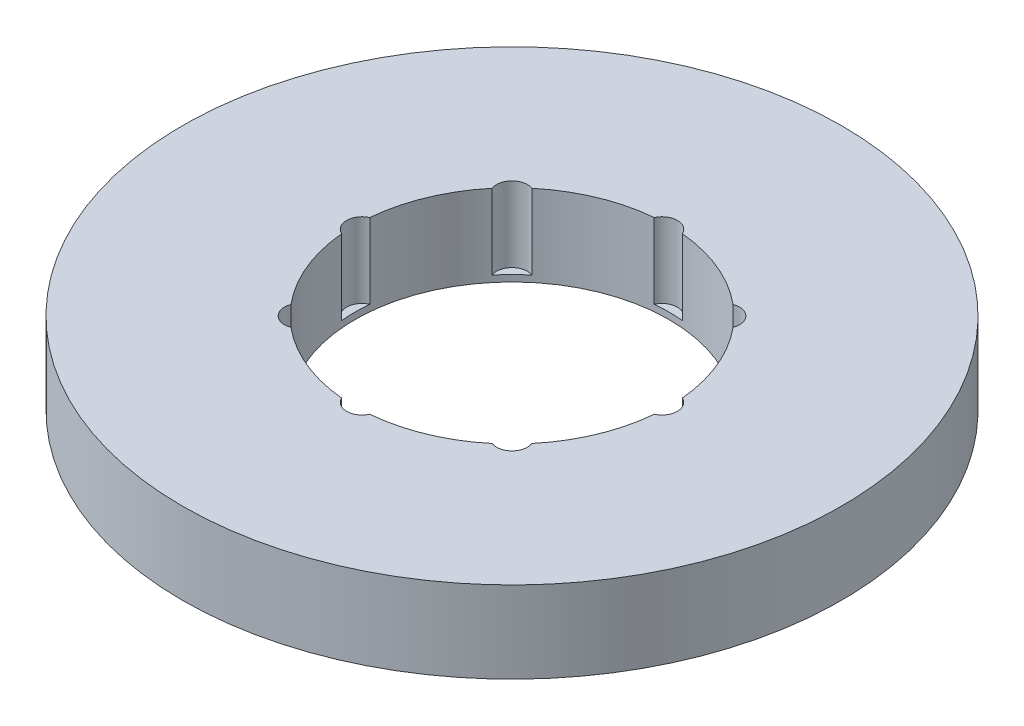
ISO-10303-21;
HEADER;
FILE_DESCRIPTION(('STEP AP214'),'2;1');
FILE_NAME('part.step','',(''),(''),'','','');
FILE_SCHEMA(('AUTOMOTIVE_DESIGN { 1 0 10303 214 1 1 1 1 }'));
ENDSEC;
DATA;
#1=APPLICATION_CONTEXT('core data for automotive mechanical design processes');
#2=APPLICATION_PROTOCOL_DEFINITION('international standard','automotive_design',2000,#1);
#3=PRODUCT_CONTEXT('',#1,'mechanical');
#4=PRODUCT('Part','Part','',(#3));
#5=PRODUCT_RELATED_PRODUCT_CATEGORY('part','',(#4));
#6=PRODUCT_DEFINITION_FORMATION('','',#4);
#7=PRODUCT_DEFINITION_CONTEXT('part definition',#1,'design');
#8=PRODUCT_DEFINITION('design','',#6,#7);
#9=PRODUCT_DEFINITION_SHAPE('','',#8);
#10=(LENGTH_UNIT() NAMED_UNIT(*) SI_UNIT(.MILLI.,.METRE.));
#11=(NAMED_UNIT(*) PLANE_ANGLE_UNIT() SI_UNIT($,.RADIAN.));
#12=(NAMED_UNIT(*) SI_UNIT($,.STERADIAN.) SOLID_ANGLE_UNIT());
#13=UNCERTAINTY_MEASURE_WITH_UNIT(LENGTH_MEASURE(1.E-05),#10,'distance_accuracy_value','');
#14=(GEOMETRIC_REPRESENTATION_CONTEXT(3) GLOBAL_UNCERTAINTY_ASSIGNED_CONTEXT((#13)) GLOBAL_UNIT_ASSIGNED_CONTEXT((#10,
#11,#12)) REPRESENTATION_CONTEXT('',''));
#15=CARTESIAN_POINT('',(0.,0.,0.));
#16=DIRECTION('',(0.,0.,1.));
#17=DIRECTION('',(1.,0.,0.));
#18=AXIS2_PLACEMENT_3D('',#15,#16,#17);
#19=CARTESIAN_POINT('',(0.,13.,0.));
#20=DIRECTION('',(0.,-1.,0.));
#21=DIRECTION('',(0.,0.,-1.));
#22=AXIS2_PLACEMENT_3D('',#19,#20,#21);
#23=CYLINDRICAL_SURFACE('',#22,52.5);
#24=CARTESIAN_POINT('',(0.,13.,0.));
#25=DIRECTION('',(0.,1.,0.));
#26=DIRECTION('',(0.,0.,1.));
#27=AXIS2_PLACEMENT_3D('',#24,#25,#26);
#28=CIRCLE('',#27,52.5);
#29=CARTESIAN_POINT('',(0.,13.,-52.5));
#30=VERTEX_POINT('',#29);
#31=EDGE_CURVE('E183',#30,#30,#28,.T.);
#32=CARTESIAN_POINT('',(0.,0.,0.));
#33=DIRECTION('',(0.,1.,0.));
#34=DIRECTION('',(0.,0.,1.));
#35=AXIS2_PLACEMENT_3D('',#32,#33,#34);
#36=CIRCLE('',#35,52.5);
#37=CARTESIAN_POINT('',(0.,0.,-52.5));
#38=VERTEX_POINT('',#37);
#39=EDGE_CURVE('E182',#38,#38,#36,.T.);
#40=CARTESIAN_POINT('',(0.,13.,-52.5));
#41=CARTESIAN_POINT('',(0.,12.8645833333333,-52.5));
#42=CARTESIAN_POINT('',(0.,12.7291666666667,-52.5));
#43=CARTESIAN_POINT('',(0.,12.4583333333333,-52.5));
#44=CARTESIAN_POINT('',(0.,12.3229166666667,-52.5));
#45=CARTESIAN_POINT('',(0.,12.0520833333333,-52.5));
#46=CARTESIAN_POINT('',(0.,11.9166666666667,-52.5));
#47=CARTESIAN_POINT('',(0.,11.6458333333333,-52.5));
#48=CARTESIAN_POINT('',(0.,11.5104166666667,-52.5));
#49=CARTESIAN_POINT('',(0.,11.2395833333333,-52.5));
#50=CARTESIAN_POINT('',(0.,11.1041666666667,-52.5));
#51=CARTESIAN_POINT('',(0.,10.8333333333333,-52.5));
#52=CARTESIAN_POINT('',(0.,10.6979166666667,-52.5));
#53=CARTESIAN_POINT('',(0.,10.4270833333333,-52.5));
#54=CARTESIAN_POINT('',(0.,10.2916666666667,-52.5));
#55=CARTESIAN_POINT('',(0.,10.0208333333333,-52.5));
#56=CARTESIAN_POINT('',(0.,9.88541666666667,-52.5));
#57=CARTESIAN_POINT('',(0.,9.61458333333333,-52.5));
#58=CARTESIAN_POINT('',(0.,9.47916666666667,-52.5));
#59=CARTESIAN_POINT('',(0.,9.20833333333333,-52.5));
#60=CARTESIAN_POINT('',(0.,9.07291666666667,-52.5));
#61=CARTESIAN_POINT('',(0.,8.80208333333333,-52.5));
#62=CARTESIAN_POINT('',(0.,8.66666666666667,-52.5));
#63=CARTESIAN_POINT('',(0.,8.39583333333333,-52.5));
#64=CARTESIAN_POINT('',(0.,8.26041666666667,-52.5));
#65=CARTESIAN_POINT('',(0.,7.98958333333333,-52.5));
#66=CARTESIAN_POINT('',(0.,7.85416666666667,-52.5));
#67=CARTESIAN_POINT('',(0.,7.58333333333333,-52.5));
#68=CARTESIAN_POINT('',(0.,7.44791666666667,-52.5));
#69=CARTESIAN_POINT('',(0.,7.17708333333333,-52.5));
#70=CARTESIAN_POINT('',(0.,7.04166666666667,-52.5));
#71=CARTESIAN_POINT('',(0.,6.77083333333333,-52.5));
#72=CARTESIAN_POINT('',(0.,6.63541666666667,-52.5));
#73=CARTESIAN_POINT('',(0.,6.36458333333333,-52.5));
#74=CARTESIAN_POINT('',(0.,6.22916666666667,-52.5));
#75=CARTESIAN_POINT('',(0.,5.95833333333333,-52.5));
#76=CARTESIAN_POINT('',(0.,5.82291666666667,-52.5));
#77=CARTESIAN_POINT('',(0.,5.55208333333333,-52.5));
#78=CARTESIAN_POINT('',(0.,5.41666666666667,-52.5));
#79=CARTESIAN_POINT('',(0.,5.14583333333333,-52.5));
#80=CARTESIAN_POINT('',(0.,5.01041666666667,-52.5));
#81=CARTESIAN_POINT('',(0.,4.73958333333333,-52.5));
#82=CARTESIAN_POINT('',(0.,4.60416666666667,-52.5));
#83=CARTESIAN_POINT('',(0.,4.33333333333333,-52.5));
#84=CARTESIAN_POINT('',(0.,4.19791666666667,-52.5));
#85=CARTESIAN_POINT('',(0.,3.92708333333333,-52.5));
#86=CARTESIAN_POINT('',(0.,3.79166666666667,-52.5));
#87=CARTESIAN_POINT('',(0.,3.52083333333333,-52.5));
#88=CARTESIAN_POINT('',(0.,3.38541666666667,-52.5));
#89=CARTESIAN_POINT('',(0.,3.11458333333333,-52.5));
#90=CARTESIAN_POINT('',(0.,2.97916666666667,-52.5));
#91=CARTESIAN_POINT('',(0.,2.70833333333333,-52.5));
#92=CARTESIAN_POINT('',(0.,2.57291666666667,-52.5));
#93=CARTESIAN_POINT('',(0.,2.30208333333333,-52.5));
#94=CARTESIAN_POINT('',(0.,2.16666666666667,-52.5));
#95=CARTESIAN_POINT('',(0.,1.89583333333333,-52.5));
#96=CARTESIAN_POINT('',(0.,1.76041666666667,-52.5));
#97=CARTESIAN_POINT('',(0.,1.48958333333333,-52.5));
#98=CARTESIAN_POINT('',(0.,1.35416666666667,-52.5));
#99=CARTESIAN_POINT('',(0.,1.08333333333333,-52.5));
#100=CARTESIAN_POINT('',(0.,0.947916666666667,-52.5));
#101=CARTESIAN_POINT('',(0.,0.677083333333334,-52.5));
#102=CARTESIAN_POINT('',(0.,0.541666666666667,-52.5));
#103=CARTESIAN_POINT('',(0.,0.270833333333334,-52.5));
#104=CARTESIAN_POINT('',(0.,0.135416666666667,-52.5));
#105=CARTESIAN_POINT('',(0.,0.,-52.5));
#106=B_SPLINE_CURVE_WITH_KNOTS('',3,(#40,#41,#42,#43,#44,#45,#46,#47,#48,#49,#50,#51,#52,#53,
#54,#55,#56,#57,#58,#59,#60,#61,#62,#63,#64,#65,#66,#67,#68,#69,#70,#71,#72,#73,#74,#75,#76,#77,
#78,#79,#80,#81,#82,#83,#84,#85,#86,#87,#88,#89,#90,#91,#92,#93,#94,#95,#96,#97,#98,#99,#100,
#101,#102,#103,#104,#105),.UNSPECIFIED.,.F.,.F.,(4,2,2,2,2,2,2,2,2,2,2,2,2,2,2,2,2,2,2,2,2,2,2,
2,2,2,2,2,2,2,2,2,4),(0.,0.406249999999999,0.812499999999999,1.21875,1.625,2.03125,2.4375,
2.84375,3.25,3.65625,4.0625,4.46875,4.875,5.28125,5.6875,6.09375,6.5,6.90625,7.3125,7.71875,
8.125,8.53125,8.9375,9.34375,9.75,10.15625,10.5625,10.96875,11.375,11.78125,12.1875,12.59375,
13.),.UNSPECIFIED.);
#107=EDGE_CURVE('BSEAM39',#30,#38,#106,.T.);
#108=ORIENTED_EDGE('',*,*,#31,.F.);
#109=ORIENTED_EDGE('',*,*,#39,.T.);
#110=ORIENTED_EDGE('',*,*,#107,.T.);
#111=ORIENTED_EDGE('',*,*,#107,.F.);
#112=EDGE_LOOP('',(#108,#110,#109,#111));
#113=FACE_BOUND('',#112,.T.);
#114=ADVANCED_FACE('F39',(#113),#23,.T.);
#115=CARTESIAN_POINT('',(0.,13.,0.));
#116=DIRECTION('',(0.,1.,0.));
#117=DIRECTION('',(0.,0.,1.));
#118=AXIS2_PLACEMENT_3D('',#115,#116,#117);
#119=PLANE('',#118);
#120=CARTESIAN_POINT('',(0.,13.,23.8825424149674));
#121=DIRECTION('',(0.,1.,0.));
#122=DIRECTION('',(1.,0.,0.));
#123=AXIS2_PLACEMENT_3D('',#120,#121,#122);
#124=CIRCLE('',#123,2.46055285388541);
#125=CARTESIAN_POINT('',(-2.24061147688682,13.,24.8993907598086));
#126=VERTEX_POINT('',#125);
#127=CARTESIAN_POINT('',(2.24061147688699,13.,24.8993907598086));
#128=VERTEX_POINT('',#127);
#129=EDGE_CURVE('E256',#126,#128,#124,.T.);
#130=ORIENTED_EDGE('',*,*,#129,.F.);
#131=CARTESIAN_POINT('',(0.,13.,0.));
#132=DIRECTION('',(0.,1.,0.));
#133=DIRECTION('',(0.,0.,1.));
#134=AXIS2_PLACEMENT_3D('',#131,#132,#133);
#135=CIRCLE('',#134,25.);
#136=CARTESIAN_POINT('',(-16.0221764843632,13.,19.1908796229855));
#137=VERTEX_POINT('',#136);
#138=EDGE_CURVE('E175',#137,#126,#135,.T.);
#139=ORIENTED_EDGE('',*,*,#138,.F.);
#140=CARTESIAN_POINT('',(-16.8875076935988,13.,16.8875076935988));
#141=DIRECTION('',(0.,1.,0.));
#142=DIRECTION('',(0.707106781186549,0.,0.707106781186546));
#143=AXIS2_PLACEMENT_3D('',#140,#141,#142);
#144=CIRCLE('',#143,2.46055285388541);
#145=CARTESIAN_POINT('',(-19.1908796229854,13.,16.0221764843632));
#146=VERTEX_POINT('',#145);
#147=EDGE_CURVE('E152',#146,#137,#144,.T.);
#148=ORIENTED_EDGE('',*,*,#147,.F.);
#149=CARTESIAN_POINT('',(-24.8993907598086,13.,2.2406114768869));
#150=VERTEX_POINT('',#149);
#151=EDGE_CURVE('E168',#150,#146,#135,.T.);
#152=ORIENTED_EDGE('',*,*,#151,.F.);
#153=CARTESIAN_POINT('',(-23.8825424149674,13.,0.));
#154=DIRECTION('',(0.,1.,0.));
#155=DIRECTION('',(0.,0.,1.));
#156=AXIS2_PLACEMENT_3D('',#153,#154,#155);
#157=CIRCLE('',#156,2.46055285388541);
#158=CARTESIAN_POINT('',(-24.8993907598086,13.,-2.2406114768869));
#159=VERTEX_POINT('',#158);
#160=EDGE_CURVE('E205',#159,#150,#157,.T.);
#161=ORIENTED_EDGE('',*,*,#160,.F.);
#162=CARTESIAN_POINT('',(-19.1908796229857,13.,-16.022176484363));
#163=VERTEX_POINT('',#162);
#164=EDGE_CURVE('E181',#163,#159,#135,.T.);
#165=ORIENTED_EDGE('',*,*,#164,.F.);
#166=CARTESIAN_POINT('',(-16.887507693599,13.,-16.8875076935986));
#167=DIRECTION('',(0.,1.,0.));
#168=DIRECTION('',(-0.707106781186539,0.,0.707106781186556));
#169=AXIS2_PLACEMENT_3D('',#166,#167,#168);
#170=CIRCLE('',#169,2.46055285388541);
#171=CARTESIAN_POINT('',(-16.0221764843634,13.,-19.1908796229853));
#172=VERTEX_POINT('',#171);
#173=EDGE_CURVE('E453',#172,#163,#170,.T.);
#174=ORIENTED_EDGE('',*,*,#173,.F.);
#175=CARTESIAN_POINT('',(-2.24061147688716,13.,-24.8993907598086));
#176=VERTEX_POINT('',#175);
#177=EDGE_CURVE('E189',#176,#172,#135,.T.);
#178=ORIENTED_EDGE('',*,*,#177,.F.);
#179=CARTESIAN_POINT('',(-2.50156353497965E-13,13.,-23.8825424149674));
#180=DIRECTION('',(0.,1.,0.));
#181=DIRECTION('',(-1.,0.,0.));
#182=AXIS2_PLACEMENT_3D('',#179,#180,#181);
#183=CIRCLE('',#182,2.46055285388541);
#184=CARTESIAN_POINT('',(2.24061147688664,13.,-24.8993907598086));
#185=VERTEX_POINT('',#184);
#186=EDGE_CURVE('E462',#185,#176,#183,.T.);
#187=ORIENTED_EDGE('',*,*,#186,.F.);
#188=CARTESIAN_POINT('',(16.022176484363,13.,-19.1908796229856));
#189=VERTEX_POINT('',#188);
#190=EDGE_CURVE('E197',#189,#185,#135,.T.);
#191=ORIENTED_EDGE('',*,*,#190,.F.);
#192=CARTESIAN_POINT('',(16.8875076935986,13.,-16.8875076935989));
#193=DIRECTION('',(0.,1.,0.));
#194=DIRECTION('',(-0.707106781186554,0.,-0.707106781186541));
#195=AXIS2_PLACEMENT_3D('',#192,#193,#194);
#196=CIRCLE('',#195,2.46055285388541);
#197=CARTESIAN_POINT('',(19.1908796229853,13.,-16.0221764843634));
#198=VERTEX_POINT('',#197);
#199=EDGE_CURVE('E470',#198,#189,#196,.T.);
#200=ORIENTED_EDGE('',*,*,#199,.F.);
#201=CARTESIAN_POINT('',(24.8993907598086,13.,-2.2406114768869));
#202=VERTEX_POINT('',#201);
#203=EDGE_CURVE('E489',#202,#198,#135,.T.);
#204=ORIENTED_EDGE('',*,*,#203,.F.);
#205=CARTESIAN_POINT('',(23.8825424149674,13.,0.));
#206=DIRECTION('',(0.,1.,0.));
#207=DIRECTION('',(0.,0.,-1.));
#208=AXIS2_PLACEMENT_3D('',#205,#206,#207);
#209=CIRCLE('',#208,2.46055285388541);
#210=CARTESIAN_POINT('',(24.8993907598086,13.,2.2406114768869));
#211=VERTEX_POINT('',#210);
#212=EDGE_CURVE('E476',#211,#202,#209,.T.);
#213=ORIENTED_EDGE('',*,*,#212,.F.);
#214=CARTESIAN_POINT('',(19.1908796229856,13.,16.0221764843631));
#215=VERTEX_POINT('',#214);
#216=EDGE_CURVE('E491',#215,#211,#135,.T.);
#217=ORIENTED_EDGE('',*,*,#216,.F.);
#218=CARTESIAN_POINT('',(16.8875076935989,13.,16.8875076935987));
#219=DIRECTION('',(0.,1.,0.));
#220=DIRECTION('',(0.707106781186544,0.,-0.707106781186551));
#221=AXIS2_PLACEMENT_3D('',#218,#219,#220);
#222=CIRCLE('',#221,2.46055285388541);
#223=CARTESIAN_POINT('',(16.0221764843633,13.,19.1908796229854));
#224=VERTEX_POINT('',#223);
#225=EDGE_CURVE('E475',#224,#215,#222,.T.);
#226=ORIENTED_EDGE('',*,*,#225,.F.);
#227=EDGE_CURVE('E190',#128,#224,#135,.T.);
#228=ORIENTED_EDGE('',*,*,#227,.F.);
#229=EDGE_LOOP('',(#130,#139,#148,#152,#161,#165,#174,#178,#187,#191,#200,#204,#213,#217,#226,#228));
#230=FACE_BOUND('',#229,.T.);
#231=ORIENTED_EDGE('',*,*,#31,.T.);
#232=EDGE_LOOP('',(#231));
#233=FACE_BOUND('',#232,.T.);
#234=ADVANCED_FACE('F170',(#230,#233),#119,.T.);
#235=CARTESIAN_POINT('',(0.,0.,0.));
#236=DIRECTION('',(0.,1.,0.));
#237=DIRECTION('',(0.,0.,1.));
#238=AXIS2_PLACEMENT_3D('',#235,#236,#237);
#239=PLANE('',#238);
#240=CARTESIAN_POINT('',(0.,0.,0.));
#241=DIRECTION('',(0.,1.,0.));
#242=DIRECTION('',(0.,0.,1.));
#243=AXIS2_PLACEMENT_3D('',#240,#241,#242);
#244=CIRCLE('',#243,25.);
#245=CARTESIAN_POINT('',(0.,0.,25.));
#246=VERTEX_POINT('',#245);
#247=EDGE_CURVE('E191',#246,#246,#244,.T.);
#248=ORIENTED_EDGE('',*,*,#247,.T.);
#249=EDGE_LOOP('',(#248));
#250=FACE_BOUND('',#249,.T.);
#251=ORIENTED_EDGE('',*,*,#39,.F.);
#252=EDGE_LOOP('',(#251));
#253=FACE_BOUND('',#252,.T.);
#254=ADVANCED_FACE('F277',(#250,#253),#239,.F.);
#255=CARTESIAN_POINT('',(0.,13.,0.));
#256=DIRECTION('',(0.,-1.,0.));
#257=DIRECTION('',(0.,0.,-1.));
#258=AXIS2_PLACEMENT_3D('',#255,#256,#257);
#259=CYLINDRICAL_SURFACE('',#258,25.);
#260=DIRECTION('',(0.,1.,0.));
#261=VECTOR('',#260,1.);
#262=CARTESIAN_POINT('',(-2.24061147688682,7.01626948269705,24.8993907598086));
#263=LINE('',#262,#261);
#264=CARTESIAN_POINT('',(-2.24061147688682,1.0325389653941,24.8993907598086));
#265=VERTEX_POINT('',#264);
#266=EDGE_CURVE('E11',#265,#126,#263,.T.);
#267=ORIENTED_EDGE('',*,*,#266,.F.);
#268=CARTESIAN_POINT('',(0.,1.0325389653941,0.));
#269=DIRECTION('',(0.,1.,0.));
#270=DIRECTION('',(0.,0.,1.));
#271=AXIS2_PLACEMENT_3D('',#268,#269,#270);
#272=CIRCLE('',#271,25.);
#273=CARTESIAN_POINT('',(2.24061147688699,1.0325389653941,24.8993907598086));
#274=VERTEX_POINT('',#273);
#275=EDGE_CURVE('E251',#265,#274,#272,.T.);
#276=ORIENTED_EDGE('',*,*,#275,.T.);
#277=DIRECTION('',(0.,1.,0.));
#278=VECTOR('',#277,1.);
#279=CARTESIAN_POINT('',(2.24061147688699,7.01626948269705,24.8993907598086));
#280=LINE('',#279,#278);
#281=EDGE_CURVE('E46',#128,#274,#280,.F.);
#282=ORIENTED_EDGE('',*,*,#281,.F.);
#283=ORIENTED_EDGE('',*,*,#227,.T.);
#284=DIRECTION('',(0.,1.,0.));
#285=VECTOR('',#284,1.);
#286=CARTESIAN_POINT('',(16.0221764843633,7.01626948269705,19.1908796229854));
#287=LINE('',#286,#285);
#288=CARTESIAN_POINT('',(16.0221764843633,1.0325389653941,19.1908796229854));
#289=VERTEX_POINT('',#288);
#290=EDGE_CURVE('E253',#289,#224,#287,.T.);
#291=ORIENTED_EDGE('',*,*,#290,.F.);
#292=CARTESIAN_POINT('',(0.,1.0325389653941,0.));
#293=DIRECTION('',(0.,1.,0.));
#294=DIRECTION('',(0.,0.,1.));
#295=AXIS2_PLACEMENT_3D('',#292,#293,#294);
#296=CIRCLE('',#295,25.);
#297=CARTESIAN_POINT('',(19.1908796229856,1.0325389653941,16.0221764843631));
#298=VERTEX_POINT('',#297);
#299=EDGE_CURVE('E246',#289,#298,#296,.T.);
#300=ORIENTED_EDGE('',*,*,#299,.T.);
#301=DIRECTION('',(0.,1.,0.));
#302=VECTOR('',#301,1.);
#303=CARTESIAN_POINT('',(19.1908796229856,7.01626948269705,16.0221764843631));
#304=LINE('',#303,#302);
#305=EDGE_CURVE('E248',#215,#298,#304,.F.);
#306=ORIENTED_EDGE('',*,*,#305,.F.);
#307=ORIENTED_EDGE('',*,*,#216,.T.);
#308=DIRECTION('',(0.,1.,0.));
#309=VECTOR('',#308,1.);
#310=CARTESIAN_POINT('',(24.8993907598086,7.01626948269705,2.2406114768869));
#311=LINE('',#310,#309);
#312=CARTESIAN_POINT('',(24.8993907598086,1.0325389653941,2.2406114768869));
#313=VERTEX_POINT('',#312);
#314=EDGE_CURVE('E243',#313,#211,#311,.T.);
#315=ORIENTED_EDGE('',*,*,#314,.F.);
#316=CARTESIAN_POINT('',(0.,1.0325389653941,0.));
#317=DIRECTION('',(0.,1.,0.));
#318=DIRECTION('',(0.,0.,1.));
#319=AXIS2_PLACEMENT_3D('',#316,#317,#318);
#320=CIRCLE('',#319,25.);
#321=CARTESIAN_POINT('',(24.8993907598086,1.0325389653941,-2.2406114768869));
#322=VERTEX_POINT('',#321);
#323=EDGE_CURVE('E236',#313,#322,#320,.T.);
#324=ORIENTED_EDGE('',*,*,#323,.T.);
#325=DIRECTION('',(0.,1.,0.));
#326=VECTOR('',#325,1.);
#327=CARTESIAN_POINT('',(24.8993907598086,7.01626948269705,-2.2406114768869));
#328=LINE('',#327,#326);
#329=EDGE_CURVE('E241',#202,#322,#328,.F.);
#330=ORIENTED_EDGE('',*,*,#329,.F.);
#331=ORIENTED_EDGE('',*,*,#203,.T.);
#332=DIRECTION('',(0.,1.,0.));
#333=VECTOR('',#332,1.);
#334=CARTESIAN_POINT('',(19.1908796229853,7.01626948269705,-16.0221764843634));
#335=LINE('',#334,#333);
#336=CARTESIAN_POINT('',(19.1908796229853,1.0325389653941,-16.0221764843634));
#337=VERTEX_POINT('',#336);
#338=EDGE_CURVE('E237',#337,#198,#335,.T.);
#339=ORIENTED_EDGE('',*,*,#338,.F.);
#340=CARTESIAN_POINT('',(0.,1.0325389653941,0.));
#341=DIRECTION('',(0.,1.,0.));
#342=DIRECTION('',(0.,0.,1.));
#343=AXIS2_PLACEMENT_3D('',#340,#341,#342);
#344=CIRCLE('',#343,25.);
#345=CARTESIAN_POINT('',(16.022176484363,1.0325389653941,-19.1908796229856));
#346=VERTEX_POINT('',#345);
#347=EDGE_CURVE('E229',#337,#346,#344,.T.);
#348=ORIENTED_EDGE('',*,*,#347,.T.);
#349=DIRECTION('',(0.,1.,0.));
#350=VECTOR('',#349,1.);
#351=CARTESIAN_POINT('',(16.022176484363,7.01626948269705,-19.1908796229856));
#352=LINE('',#351,#350);
#353=EDGE_CURVE('E232',#189,#346,#352,.F.);
#354=ORIENTED_EDGE('',*,*,#353,.F.);
#355=ORIENTED_EDGE('',*,*,#190,.T.);
#356=DIRECTION('',(0.,1.,0.));
#357=VECTOR('',#356,1.);
#358=CARTESIAN_POINT('',(2.24061147688664,7.01626948269705,-24.8993907598086));
#359=LINE('',#358,#357);
#360=CARTESIAN_POINT('',(2.24061147688664,1.0325389653941,-24.8993907598086));
#361=VERTEX_POINT('',#360);
#362=EDGE_CURVE('E227',#361,#185,#359,.T.);
#363=ORIENTED_EDGE('',*,*,#362,.F.);
#364=CARTESIAN_POINT('',(0.,1.0325389653941,0.));
#365=DIRECTION('',(0.,1.,0.));
#366=DIRECTION('',(0.,0.,1.));
#367=AXIS2_PLACEMENT_3D('',#364,#365,#366);
#368=CIRCLE('',#367,25.);
#369=CARTESIAN_POINT('',(-2.24061147688716,1.0325389653941,-24.8993907598086));
#370=VERTEX_POINT('',#369);
#371=EDGE_CURVE('E225',#361,#370,#368,.T.);
#372=ORIENTED_EDGE('',*,*,#371,.T.);
#373=DIRECTION('',(0.,1.,0.));
#374=VECTOR('',#373,1.);
#375=CARTESIAN_POINT('',(-2.24061147688716,7.01626948269705,-24.8993907598086));
#376=LINE('',#375,#374);
#377=EDGE_CURVE('E223',#176,#370,#376,.F.);
#378=ORIENTED_EDGE('',*,*,#377,.F.);
#379=ORIENTED_EDGE('',*,*,#177,.T.);
#380=DIRECTION('',(0.,1.,0.));
#381=VECTOR('',#380,1.);
#382=CARTESIAN_POINT('',(-16.0221764843634,7.01626948269705,-19.1908796229853));
#383=LINE('',#382,#381);
#384=CARTESIAN_POINT('',(-16.0221764843634,1.0325389653941,-19.1908796229853));
#385=VERTEX_POINT('',#384);
#386=EDGE_CURVE('E219',#385,#172,#383,.T.);
#387=ORIENTED_EDGE('',*,*,#386,.F.);
#388=CARTESIAN_POINT('',(0.,1.0325389653941,0.));
#389=DIRECTION('',(0.,1.,0.));
#390=DIRECTION('',(0.,0.,1.));
#391=AXIS2_PLACEMENT_3D('',#388,#389,#390);
#392=CIRCLE('',#391,25.);
#393=CARTESIAN_POINT('',(-19.1908796229857,1.0325389653941,-16.022176484363));
#394=VERTEX_POINT('',#393);
#395=EDGE_CURVE('E159',#385,#394,#392,.T.);
#396=ORIENTED_EDGE('',*,*,#395,.T.);
#397=DIRECTION('',(0.,1.,0.));
#398=VECTOR('',#397,1.);
#399=CARTESIAN_POINT('',(-19.1908796229857,7.01626948269705,-16.022176484363));
#400=LINE('',#399,#398);
#401=EDGE_CURVE('E220',#163,#394,#400,.F.);
#402=ORIENTED_EDGE('',*,*,#401,.F.);
#403=ORIENTED_EDGE('',*,*,#164,.T.);
#404=DIRECTION('',(0.,1.,0.));
#405=VECTOR('',#404,1.);
#406=CARTESIAN_POINT('',(-24.8993907598086,7.01626948269705,-2.2406114768869));
#407=LINE('',#406,#405);
#408=CARTESIAN_POINT('',(-24.8993907598086,1.0325389653941,-2.2406114768869));
#409=VERTEX_POINT('',#408);
#410=EDGE_CURVE('E209',#409,#159,#407,.T.);
#411=ORIENTED_EDGE('',*,*,#410,.F.);
#412=CARTESIAN_POINT('',(0.,1.0325389653941,0.));
#413=DIRECTION('',(0.,1.,0.));
#414=DIRECTION('',(0.,0.,1.));
#415=AXIS2_PLACEMENT_3D('',#412,#413,#414);
#416=CIRCLE('',#415,25.);
#417=CARTESIAN_POINT('',(-24.8993907598086,1.0325389653941,2.2406114768869));
#418=VERTEX_POINT('',#417);
#419=EDGE_CURVE('E206',#409,#418,#416,.T.);
#420=ORIENTED_EDGE('',*,*,#419,.T.);
#421=DIRECTION('',(0.,1.,0.));
#422=VECTOR('',#421,1.);
#423=CARTESIAN_POINT('',(-24.8993907598086,7.01626948269705,2.2406114768869));
#424=LINE('',#423,#422);
#425=EDGE_CURVE('E179',#150,#418,#424,.F.);
#426=ORIENTED_EDGE('',*,*,#425,.F.);
#427=ORIENTED_EDGE('',*,*,#151,.T.);
#428=DIRECTION('',(0.,1.,0.));
#429=VECTOR('',#428,1.);
#430=CARTESIAN_POINT('',(-19.1908796229854,7.01626948269705,16.0221764843632));
#431=LINE('',#430,#429);
#432=CARTESIAN_POINT('',(-19.1908796229854,1.0325389653941,16.0221764843632));
#433=VERTEX_POINT('',#432);
#434=EDGE_CURVE('E147',#433,#146,#431,.T.);
#435=ORIENTED_EDGE('',*,*,#434,.F.);
#436=CARTESIAN_POINT('',(0.,1.0325389653941,0.));
#437=DIRECTION('',(0.,1.,0.));
#438=DIRECTION('',(0.,0.,1.));
#439=AXIS2_PLACEMENT_3D('',#436,#437,#438);
#440=CIRCLE('',#439,25.);
#441=CARTESIAN_POINT('',(-16.0221764843632,1.0325389653941,19.1908796229855));
#442=VERTEX_POINT('',#441);
#443=EDGE_CURVE('E215',#433,#442,#440,.T.);
#444=ORIENTED_EDGE('',*,*,#443,.T.);
#445=DIRECTION('',(0.,1.,0.));
#446=VECTOR('',#445,1.);
#447=CARTESIAN_POINT('',(-16.0221764843632,7.01626948269705,19.1908796229855));
#448=LINE('',#447,#446);
#449=EDGE_CURVE('E161',#137,#442,#448,.F.);
#450=ORIENTED_EDGE('',*,*,#449,.F.);
#451=ORIENTED_EDGE('',*,*,#138,.T.);
#452=EDGE_LOOP('',(#267,#276,#282,#283,#291,#300,#306,#307,#315,#324,#330,#331,#339,#348,#354,
#355,#363,#372,#378,#379,#387,#396,#402,#403,#411,#420,#426,#427,#435,#444,#450,#451));
#453=FACE_BOUND('',#452,.T.);
#454=ORIENTED_EDGE('',*,*,#247,.F.);
#455=EDGE_LOOP('',(#454));
#456=FACE_BOUND('',#455,.T.);
#457=ADVANCED_FACE('F176',(#453,#456),#259,.F.);
#458=CARTESIAN_POINT('',(-23.8825424149674,1.0325389653941,0.));
#459=DIRECTION('',(0.,1.,0.));
#460=DIRECTION('',(0.,0.,1.));
#461=AXIS2_PLACEMENT_3D('',#458,#459,#460);
#462=CYLINDRICAL_SURFACE('',#461,2.46055285388541);
#463=ORIENTED_EDGE('',*,*,#410,.T.);
#464=ORIENTED_EDGE('',*,*,#160,.T.);
#465=ORIENTED_EDGE('',*,*,#425,.T.);
#466=CARTESIAN_POINT('',(-23.8825424149674,1.0325389653941,0.));
#467=DIRECTION('',(0.,1.,0.));
#468=DIRECTION('',(0.,0.,1.));
#469=AXIS2_PLACEMENT_3D('',#466,#467,#468);
#470=CIRCLE('',#469,2.46055285388541);
#471=EDGE_CURVE('E200',#409,#418,#470,.T.);
#472=ORIENTED_EDGE('',*,*,#471,.F.);
#473=EDGE_LOOP('',(#463,#464,#465,#472));
#474=FACE_BOUND('',#473,.T.);
#475=ADVANCED_FACE('F286',(#474),#462,.F.);
#476=CARTESIAN_POINT('',(-23.8825424149674,1.0325389653941,0.));
#477=DIRECTION('',(0.,1.,0.));
#478=DIRECTION('',(0.,0.,1.));
#479=AXIS2_PLACEMENT_3D('',#476,#477,#478);
#480=PLANE('',#479);
#481=ORIENTED_EDGE('',*,*,#471,.T.);
#482=ORIENTED_EDGE('',*,*,#419,.F.);
#483=EDGE_LOOP('',(#481,#482));
#484=FACE_BOUND('',#483,.T.);
#485=ADVANCED_FACE('F289',(#484),#480,.T.);
#486=CARTESIAN_POINT('',(-16.8875076935988,1.0325389653941,16.8875076935988));
#487=DIRECTION('',(0.,1.,0.));
#488=DIRECTION('',(0.,0.,1.));
#489=AXIS2_PLACEMENT_3D('',#486,#487,#488);
#490=CYLINDRICAL_SURFACE('',#489,2.46055285388541);
#491=ORIENTED_EDGE('',*,*,#434,.T.);
#492=ORIENTED_EDGE('',*,*,#147,.T.);
#493=ORIENTED_EDGE('',*,*,#449,.T.);
#494=CARTESIAN_POINT('',(-16.8875076935988,1.0325389653941,16.8875076935988));
#495=DIRECTION('',(0.,1.,0.));
#496=DIRECTION('',(0.707106781186549,0.,0.707106781186546));
#497=AXIS2_PLACEMENT_3D('',#494,#495,#496);
#498=CIRCLE('',#497,2.46055285388541);
#499=EDGE_CURVE('E156',#433,#442,#498,.T.);
#500=ORIENTED_EDGE('',*,*,#499,.F.);
#501=EDGE_LOOP('',(#491,#492,#493,#500));
#502=FACE_BOUND('',#501,.T.);
#503=ADVANCED_FACE('F155',(#502),#490,.F.);
#504=CARTESIAN_POINT('',(-16.8875076935988,1.0325389653941,16.8875076935988));
#505=DIRECTION('',(0.,1.,0.));
#506=DIRECTION('',(0.707106781186549,0.,0.707106781186546));
#507=AXIS2_PLACEMENT_3D('',#504,#505,#506);
#508=PLANE('',#507);
#509=ORIENTED_EDGE('',*,*,#499,.T.);
#510=ORIENTED_EDGE('',*,*,#443,.F.);
#511=EDGE_LOOP('',(#509,#510));
#512=FACE_BOUND('',#511,.T.);
#513=ADVANCED_FACE('F300',(#512),#508,.T.);
#514=CARTESIAN_POINT('',(-16.887507693599,1.0325389653941,-16.8875076935986));
#515=DIRECTION('',(0.,1.,0.));
#516=DIRECTION('',(0.,0.,1.));
#517=AXIS2_PLACEMENT_3D('',#514,#515,#516);
#518=CYLINDRICAL_SURFACE('',#517,2.46055285388541);
#519=ORIENTED_EDGE('',*,*,#386,.T.);
#520=ORIENTED_EDGE('',*,*,#173,.T.);
#521=ORIENTED_EDGE('',*,*,#401,.T.);
#522=CARTESIAN_POINT('',(-16.887507693599,1.0325389653941,-16.8875076935986));
#523=DIRECTION('',(0.,1.,0.));
#524=DIRECTION('',(-0.707106781186539,0.,0.707106781186556));
#525=AXIS2_PLACEMENT_3D('',#522,#523,#524);
#526=CIRCLE('',#525,2.46055285388541);
#527=EDGE_CURVE('E454',#385,#394,#526,.T.);
#528=ORIENTED_EDGE('',*,*,#527,.F.);
#529=EDGE_LOOP('',(#519,#520,#521,#528));
#530=FACE_BOUND('',#529,.T.);
#531=ADVANCED_FACE('F299',(#530),#518,.F.);
#532=CARTESIAN_POINT('',(-16.887507693599,1.0325389653941,-16.8875076935986));
#533=DIRECTION('',(0.,1.,0.));
#534=DIRECTION('',(-0.707106781186539,0.,0.707106781186556));
#535=AXIS2_PLACEMENT_3D('',#532,#533,#534);
#536=PLANE('',#535);
#537=ORIENTED_EDGE('',*,*,#527,.T.);
#538=ORIENTED_EDGE('',*,*,#395,.F.);
#539=EDGE_LOOP('',(#537,#538));
#540=FACE_BOUND('',#539,.T.);
#541=ADVANCED_FACE('F379',(#540),#536,.T.);
#542=CARTESIAN_POINT('',(-2.50156353497965E-13,1.0325389653941,-23.8825424149674));
#543=DIRECTION('',(0.,1.,0.));
#544=DIRECTION('',(0.,0.,1.));
#545=AXIS2_PLACEMENT_3D('',#542,#543,#544);
#546=CYLINDRICAL_SURFACE('',#545,2.46055285388541);
#547=ORIENTED_EDGE('',*,*,#362,.T.);
#548=ORIENTED_EDGE('',*,*,#186,.T.);
#549=ORIENTED_EDGE('',*,*,#377,.T.);
#550=CARTESIAN_POINT('',(-2.50156353497965E-13,1.0325389653941,-23.8825424149674));
#551=DIRECTION('',(0.,1.,0.));
#552=DIRECTION('',(-1.,0.,0.));
#553=AXIS2_PLACEMENT_3D('',#550,#551,#552);
#554=CIRCLE('',#553,2.46055285388541);
#555=EDGE_CURVE('E465',#361,#370,#554,.T.);
#556=ORIENTED_EDGE('',*,*,#555,.F.);
#557=EDGE_LOOP('',(#547,#548,#549,#556));
#558=FACE_BOUND('',#557,.T.);
#559=ADVANCED_FACE('F371',(#558),#546,.F.);
#560=CARTESIAN_POINT('',(-2.50156353497965E-13,1.0325389653941,-23.8825424149674));
#561=DIRECTION('',(0.,1.,0.));
#562=DIRECTION('',(-1.,0.,0.));
#563=AXIS2_PLACEMENT_3D('',#560,#561,#562);
#564=PLANE('',#563);
#565=ORIENTED_EDGE('',*,*,#555,.T.);
#566=ORIENTED_EDGE('',*,*,#371,.F.);
#567=EDGE_LOOP('',(#565,#566));
#568=FACE_BOUND('',#567,.T.);
#569=ADVANCED_FACE('F308',(#568),#564,.T.);
#570=CARTESIAN_POINT('',(16.8875076935986,1.0325389653941,-16.8875076935989));
#571=DIRECTION('',(0.,1.,0.));
#572=DIRECTION('',(0.,0.,1.));
#573=AXIS2_PLACEMENT_3D('',#570,#571,#572);
#574=CYLINDRICAL_SURFACE('',#573,2.46055285388541);
#575=ORIENTED_EDGE('',*,*,#338,.T.);
#576=ORIENTED_EDGE('',*,*,#199,.T.);
#577=ORIENTED_EDGE('',*,*,#353,.T.);
#578=CARTESIAN_POINT('',(16.8875076935986,1.0325389653941,-16.8875076935989));
#579=DIRECTION('',(0.,1.,0.));
#580=DIRECTION('',(-0.707106781186554,0.,-0.707106781186541));
#581=AXIS2_PLACEMENT_3D('',#578,#579,#580);
#582=CIRCLE('',#581,2.46055285388541);
#583=EDGE_CURVE('E477',#337,#346,#582,.T.);
#584=ORIENTED_EDGE('',*,*,#583,.F.);
#585=EDGE_LOOP('',(#575,#576,#577,#584));
#586=FACE_BOUND('',#585,.T.);
#587=ADVANCED_FACE('F305',(#586),#574,.F.);
#588=CARTESIAN_POINT('',(16.8875076935986,1.0325389653941,-16.8875076935989));
#589=DIRECTION('',(0.,1.,0.));
#590=DIRECTION('',(-0.707106781186554,0.,-0.707106781186541));
#591=AXIS2_PLACEMENT_3D('',#588,#589,#590);
#592=PLANE('',#591);
#593=ORIENTED_EDGE('',*,*,#583,.T.);
#594=ORIENTED_EDGE('',*,*,#347,.F.);
#595=EDGE_LOOP('',(#593,#594));
#596=FACE_BOUND('',#595,.T.);
#597=ADVANCED_FACE('F304',(#596),#592,.T.);
#598=CARTESIAN_POINT('',(23.8825424149674,1.0325389653941,0.));
#599=DIRECTION('',(0.,1.,0.));
#600=DIRECTION('',(0.,0.,1.));
#601=AXIS2_PLACEMENT_3D('',#598,#599,#600);
#602=CYLINDRICAL_SURFACE('',#601,2.46055285388541);
#603=ORIENTED_EDGE('',*,*,#314,.T.);
#604=ORIENTED_EDGE('',*,*,#212,.T.);
#605=ORIENTED_EDGE('',*,*,#329,.T.);
#606=CARTESIAN_POINT('',(23.8825424149674,1.0325389653941,0.));
#607=DIRECTION('',(0.,1.,0.));
#608=DIRECTION('',(0.,0.,-1.));
#609=AXIS2_PLACEMENT_3D('',#606,#607,#608);
#610=CIRCLE('',#609,2.46055285388541);
#611=EDGE_CURVE('E478',#313,#322,#610,.T.);
#612=ORIENTED_EDGE('',*,*,#611,.F.);
#613=EDGE_LOOP('',(#603,#604,#605,#612));
#614=FACE_BOUND('',#613,.T.);
#615=ADVANCED_FACE('F309',(#614),#602,.F.);
#616=CARTESIAN_POINT('',(23.8825424149674,1.0325389653941,0.));
#617=DIRECTION('',(0.,1.,0.));
#618=DIRECTION('',(0.,0.,-1.));
#619=AXIS2_PLACEMENT_3D('',#616,#617,#618);
#620=PLANE('',#619);
#621=ORIENTED_EDGE('',*,*,#611,.T.);
#622=ORIENTED_EDGE('',*,*,#323,.F.);
#623=EDGE_LOOP('',(#621,#622));
#624=FACE_BOUND('',#623,.T.);
#625=ADVANCED_FACE('F314',(#624),#620,.T.);
#626=CARTESIAN_POINT('',(16.8875076935989,1.0325389653941,16.8875076935987));
#627=DIRECTION('',(0.,1.,0.));
#628=DIRECTION('',(0.,0.,1.));
#629=AXIS2_PLACEMENT_3D('',#626,#627,#628);
#630=CYLINDRICAL_SURFACE('',#629,2.46055285388541);
#631=ORIENTED_EDGE('',*,*,#290,.T.);
#632=ORIENTED_EDGE('',*,*,#225,.T.);
#633=ORIENTED_EDGE('',*,*,#305,.T.);
#634=CARTESIAN_POINT('',(16.8875076935989,1.0325389653941,16.8875076935987));
#635=DIRECTION('',(0.,1.,0.));
#636=DIRECTION('',(0.707106781186544,0.,-0.707106781186551));
#637=AXIS2_PLACEMENT_3D('',#634,#635,#636);
#638=CIRCLE('',#637,2.46055285388541);
#639=EDGE_CURVE('E56',#289,#298,#638,.T.);
#640=ORIENTED_EDGE('',*,*,#639,.F.);
#641=EDGE_LOOP('',(#631,#632,#633,#640));
#642=FACE_BOUND('',#641,.T.);
#643=ADVANCED_FACE('F318',(#642),#630,.F.);
#644=CARTESIAN_POINT('',(16.8875076935989,1.0325389653941,16.8875076935987));
#645=DIRECTION('',(0.,1.,0.));
#646=DIRECTION('',(0.707106781186544,0.,-0.707106781186551));
#647=AXIS2_PLACEMENT_3D('',#644,#645,#646);
#648=PLANE('',#647);
#649=ORIENTED_EDGE('',*,*,#639,.T.);
#650=ORIENTED_EDGE('',*,*,#299,.F.);
#651=EDGE_LOOP('',(#649,#650));
#652=FACE_BOUND('',#651,.T.);
#653=ADVANCED_FACE('F270',(#652),#648,.T.);
#654=CARTESIAN_POINT('',(0.,1.0325389653941,23.8825424149674));
#655=DIRECTION('',(0.,1.,0.));
#656=DIRECTION('',(0.,0.,1.));
#657=AXIS2_PLACEMENT_3D('',#654,#655,#656);
#658=CYLINDRICAL_SURFACE('',#657,2.46055285388541);
#659=ORIENTED_EDGE('',*,*,#266,.T.);
#660=ORIENTED_EDGE('',*,*,#129,.T.);
#661=ORIENTED_EDGE('',*,*,#281,.T.);
#662=CARTESIAN_POINT('',(0.,1.0325389653941,23.8825424149674));
#663=DIRECTION('',(0.,1.,0.));
#664=DIRECTION('',(1.,0.,0.));
#665=AXIS2_PLACEMENT_3D('',#662,#663,#664);
#666=CIRCLE('',#665,2.46055285388541);
#667=EDGE_CURVE('E55',#265,#274,#666,.T.);
#668=ORIENTED_EDGE('',*,*,#667,.F.);
#669=EDGE_LOOP('',(#659,#660,#661,#668));
#670=FACE_BOUND('',#669,.T.);
#671=ADVANCED_FACE('F260',(#670),#658,.F.);
#672=CARTESIAN_POINT('',(0.,1.0325389653941,23.8825424149674));
#673=DIRECTION('',(0.,1.,0.));
#674=DIRECTION('',(1.,0.,0.));
#675=AXIS2_PLACEMENT_3D('',#672,#673,#674);
#676=PLANE('',#675);
#677=ORIENTED_EDGE('',*,*,#667,.T.);
#678=ORIENTED_EDGE('',*,*,#275,.F.);
#679=EDGE_LOOP('',(#677,#678));
#680=FACE_BOUND('',#679,.T.);
#681=ADVANCED_FACE('F261',(#680),#676,.T.);
#682=CLOSED_SHELL('',(#114,#234,#254,#457,#475,#485,#503,#513,#531,#541,#559,#569,#587,#597,
#615,#625,#643,#653,#671,#681));
#683=MANIFOLD_SOLID_BREP('B2',#682);
#684=ADVANCED_BREP_SHAPE_REPRESENTATION('',(#18,#683),#14);
#685=SHAPE_DEFINITION_REPRESENTATION(#9,#684);
ENDSEC;
END-ISO-10303-21;
